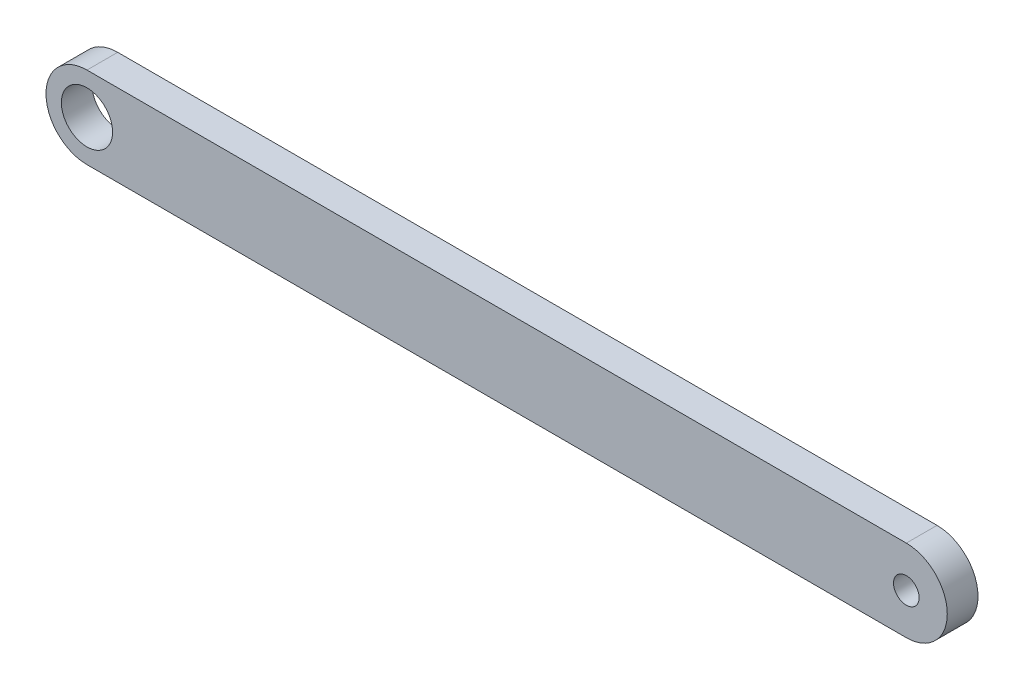
ISO-10303-21;
HEADER;
FILE_DESCRIPTION(('STEP AP214'),'2;1');
FILE_NAME('part.step','',(''),(''),'','','');
FILE_SCHEMA(('AUTOMOTIVE_DESIGN { 1 0 10303 214 1 1 1 1 }'));
ENDSEC;
DATA;
#1=APPLICATION_CONTEXT('core data for automotive mechanical design processes');
#2=APPLICATION_PROTOCOL_DEFINITION('international standard','automotive_design',2000,#1);
#3=PRODUCT_CONTEXT('',#1,'mechanical');
#4=PRODUCT('Part','Part','',(#3));
#5=PRODUCT_RELATED_PRODUCT_CATEGORY('part','',(#4));
#6=PRODUCT_DEFINITION_FORMATION('','',#4);
#7=PRODUCT_DEFINITION_CONTEXT('part definition',#1,'design');
#8=PRODUCT_DEFINITION('design','',#6,#7);
#9=PRODUCT_DEFINITION_SHAPE('','',#8);
#10=(LENGTH_UNIT() NAMED_UNIT(*) SI_UNIT(.MILLI.,.METRE.));
#11=(NAMED_UNIT(*) PLANE_ANGLE_UNIT() SI_UNIT($,.RADIAN.));
#12=(NAMED_UNIT(*) SI_UNIT($,.STERADIAN.) SOLID_ANGLE_UNIT());
#13=UNCERTAINTY_MEASURE_WITH_UNIT(LENGTH_MEASURE(1.E-05),#10,'distance_accuracy_value','');
#14=(GEOMETRIC_REPRESENTATION_CONTEXT(3) GLOBAL_UNCERTAINTY_ASSIGNED_CONTEXT((#13)) GLOBAL_UNIT_ASSIGNED_CONTEXT((#10,
#11,#12)) REPRESENTATION_CONTEXT('',''));
#15=CARTESIAN_POINT('',(0.,0.,0.));
#16=DIRECTION('',(0.,0.,1.));
#17=DIRECTION('',(1.,0.,0.));
#18=AXIS2_PLACEMENT_3D('',#15,#16,#17);
#19=CARTESIAN_POINT('',(-54.3710287071592,0.,6.));
#20=DIRECTION('',(0.,0.,1.));
#21=DIRECTION('',(1.,0.,0.));
#22=AXIS2_PLACEMENT_3D('',#19,#20,#21);
#23=PLANE('',#22);
#24=CARTESIAN_POINT('',(-54.3710287071592,0.,6.));
#25=DIRECTION('',(0.,0.,1.));
#26=DIRECTION('',(1.,0.,0.));
#27=AXIS2_PLACEMENT_3D('',#24,#25,#26);
#28=CIRCLE('',#27,5.);
#29=CARTESIAN_POINT('',(-49.3710287071592,0.,6.));
#30=VERTEX_POINT('',#29);
#31=EDGE_CURVE('E100',#30,#30,#28,.T.);
#32=ORIENTED_EDGE('',*,*,#31,.F.);
#33=EDGE_LOOP('',(#32));
#34=FACE_BOUND('',#33,.T.);
#35=CARTESIAN_POINT('',(-54.3710287071592,0.,6.));
#36=DIRECTION('',(0.,0.,1.));
#37=DIRECTION('',(1.,0.,0.));
#38=AXIS2_PLACEMENT_3D('',#35,#36,#37);
#39=CIRCLE('',#38,8.);
#40=CARTESIAN_POINT('',(-54.3710287071592,8.,6.));
#41=VERTEX_POINT('',#40);
#42=CARTESIAN_POINT('',(-54.3710287071592,-8.,6.));
#43=VERTEX_POINT('',#42);
#44=EDGE_CURVE('E85',#41,#43,#39,.T.);
#45=ORIENTED_EDGE('',*,*,#44,.T.);
#46=DIRECTION('',(1.,0.,0.));
#47=VECTOR('',#46,1.);
#48=CARTESIAN_POINT('',(-54.3710287071592,-8.,6.));
#49=LINE('',#48,#47);
#50=CARTESIAN_POINT('',(105.628971292841,-8.,6.));
#51=VERTEX_POINT('',#50);
#52=EDGE_CURVE('E80',#43,#51,#49,.T.);
#53=ORIENTED_EDGE('',*,*,#52,.T.);
#54=CARTESIAN_POINT('',(105.628971292841,0.,6.));
#55=DIRECTION('',(0.,0.,1.));
#56=DIRECTION('',(1.,0.,0.));
#57=AXIS2_PLACEMENT_3D('',#54,#55,#56);
#58=CIRCLE('',#57,8.);
#59=CARTESIAN_POINT('',(105.628971292841,8.,6.));
#60=VERTEX_POINT('',#59);
#61=EDGE_CURVE('E83',#51,#60,#58,.T.);
#62=ORIENTED_EDGE('',*,*,#61,.T.);
#63=DIRECTION('',(-1.,0.,0.));
#64=VECTOR('',#63,1.);
#65=CARTESIAN_POINT('',(-54.3710287071592,8.,6.));
#66=LINE('',#65,#64);
#67=EDGE_CURVE('E50',#60,#41,#66,.T.);
#68=ORIENTED_EDGE('',*,*,#67,.T.);
#69=EDGE_LOOP('',(#45,#53,#62,#68));
#70=FACE_BOUND('',#69,.T.);
#71=CARTESIAN_POINT('',(105.628971292841,0.,6.));
#72=DIRECTION('',(0.,0.,1.));
#73=DIRECTION('',(1.,0.,0.));
#74=AXIS2_PLACEMENT_3D('',#71,#72,#73);
#75=CIRCLE('',#74,2.5);
#76=CARTESIAN_POINT('',(108.128971292841,0.,6.));
#77=VERTEX_POINT('',#76);
#78=EDGE_CURVE('E115',#77,#77,#75,.T.);
#79=ORIENTED_EDGE('',*,*,#78,.F.);
#80=EDGE_LOOP('',(#79));
#81=FACE_BOUND('',#80,.T.);
#82=ADVANCED_FACE('F33',(#34,#70,#81),#23,.T.);
#83=CARTESIAN_POINT('',(-54.3710287071592,0.,0.));
#84=DIRECTION('',(0.,0.,1.));
#85=DIRECTION('',(1.,0.,0.));
#86=AXIS2_PLACEMENT_3D('',#83,#84,#85);
#87=PLANE('',#86);
#88=CARTESIAN_POINT('',(-54.3710287071592,0.,0.));
#89=DIRECTION('',(0.,0.,1.));
#90=DIRECTION('',(1.,0.,0.));
#91=AXIS2_PLACEMENT_3D('',#88,#89,#90);
#92=CIRCLE('',#91,8.);
#93=CARTESIAN_POINT('',(-54.3710287071592,8.,0.));
#94=VERTEX_POINT('',#93);
#95=CARTESIAN_POINT('',(-54.3710287071592,-8.,0.));
#96=VERTEX_POINT('',#95);
#97=EDGE_CURVE('E97',#94,#96,#92,.T.);
#98=ORIENTED_EDGE('',*,*,#97,.F.);
#99=DIRECTION('',(-1.,0.,0.));
#100=VECTOR('',#99,1.);
#101=CARTESIAN_POINT('',(-54.3710287071592,8.,0.));
#102=LINE('',#101,#100);
#103=CARTESIAN_POINT('',(105.628971292841,8.,0.));
#104=VERTEX_POINT('',#103);
#105=EDGE_CURVE('E73',#104,#94,#102,.T.);
#106=ORIENTED_EDGE('',*,*,#105,.F.);
#107=CARTESIAN_POINT('',(105.628971292841,0.,0.));
#108=DIRECTION('',(0.,0.,1.));
#109=DIRECTION('',(1.,0.,0.));
#110=AXIS2_PLACEMENT_3D('',#107,#108,#109);
#111=CIRCLE('',#110,8.);
#112=CARTESIAN_POINT('',(105.628971292841,-8.,0.));
#113=VERTEX_POINT('',#112);
#114=EDGE_CURVE('E67',#113,#104,#111,.T.);
#115=ORIENTED_EDGE('',*,*,#114,.F.);
#116=DIRECTION('',(1.,0.,0.));
#117=VECTOR('',#116,1.);
#118=CARTESIAN_POINT('',(-54.3710287071592,-8.,0.));
#119=LINE('',#118,#117);
#120=EDGE_CURVE('E89',#96,#113,#119,.T.);
#121=ORIENTED_EDGE('',*,*,#120,.F.);
#122=EDGE_LOOP('',(#98,#106,#115,#121));
#123=FACE_BOUND('',#122,.T.);
#124=CARTESIAN_POINT('',(-54.3710287071592,0.,0.));
#125=DIRECTION('',(0.,0.,1.));
#126=DIRECTION('',(1.,0.,0.));
#127=AXIS2_PLACEMENT_3D('',#124,#125,#126);
#128=CIRCLE('',#127,5.);
#129=CARTESIAN_POINT('',(-49.3710287071592,0.,0.));
#130=VERTEX_POINT('',#129);
#131=EDGE_CURVE('E112',#130,#130,#128,.T.);
#132=ORIENTED_EDGE('',*,*,#131,.T.);
#133=EDGE_LOOP('',(#132));
#134=FACE_BOUND('',#133,.T.);
#135=CARTESIAN_POINT('',(105.628971292841,0.,0.));
#136=DIRECTION('',(0.,0.,1.));
#137=DIRECTION('',(1.,0.,0.));
#138=AXIS2_PLACEMENT_3D('',#135,#136,#137);
#139=CIRCLE('',#138,2.5);
#140=CARTESIAN_POINT('',(108.128971292841,0.,0.));
#141=VERTEX_POINT('',#140);
#142=EDGE_CURVE('E118',#141,#141,#139,.T.);
#143=ORIENTED_EDGE('',*,*,#142,.T.);
#144=EDGE_LOOP('',(#143));
#145=FACE_BOUND('',#144,.T.);
#146=ADVANCED_FACE('F108',(#123,#134,#145),#87,.F.);
#147=CARTESIAN_POINT('',(-54.3710287071592,0.,6.));
#148=DIRECTION('',(0.,0.,-1.));
#149=DIRECTION('',(-1.,0.,0.));
#150=AXIS2_PLACEMENT_3D('',#147,#148,#149);
#151=CYLINDRICAL_SURFACE('',#150,8.);
#152=ORIENTED_EDGE('',*,*,#97,.T.);
#153=DIRECTION('',(0.,0.,-1.));
#154=VECTOR('',#153,1.);
#155=CARTESIAN_POINT('',(-54.3710287071592,-8.,6.));
#156=LINE('',#155,#154);
#157=EDGE_CURVE('E11',#43,#96,#156,.T.);
#158=ORIENTED_EDGE('',*,*,#157,.F.);
#159=ORIENTED_EDGE('',*,*,#44,.F.);
#160=DIRECTION('',(0.,0.,-1.));
#161=VECTOR('',#160,1.);
#162=CARTESIAN_POINT('',(-54.3710287071592,8.,6.));
#163=LINE('',#162,#161);
#164=EDGE_CURVE('E93',#41,#94,#163,.T.);
#165=ORIENTED_EDGE('',*,*,#164,.T.);
#166=EDGE_LOOP('',(#152,#158,#159,#165));
#167=FACE_BOUND('',#166,.T.);
#168=ADVANCED_FACE('F35',(#167),#151,.T.);
#169=CARTESIAN_POINT('',(-54.3710287071592,-8.,6.));
#170=DIRECTION('',(0.,1.,0.));
#171=DIRECTION('',(0.,0.,1.));
#172=AXIS2_PLACEMENT_3D('',#169,#170,#171);
#173=PLANE('',#172);
#174=ORIENTED_EDGE('',*,*,#120,.T.);
#175=DIRECTION('',(0.,0.,-1.));
#176=VECTOR('',#175,1.);
#177=CARTESIAN_POINT('',(105.628971292841,-8.,6.));
#178=LINE('',#177,#176);
#179=EDGE_CURVE('E42',#51,#113,#178,.T.);
#180=ORIENTED_EDGE('',*,*,#179,.F.);
#181=ORIENTED_EDGE('',*,*,#52,.F.);
#182=ORIENTED_EDGE('',*,*,#157,.T.);
#183=EDGE_LOOP('',(#174,#180,#181,#182));
#184=FACE_BOUND('',#183,.T.);
#185=ADVANCED_FACE('F88',(#184),#173,.F.);
#186=CARTESIAN_POINT('',(105.628971292841,0.,6.));
#187=DIRECTION('',(0.,0.,-1.));
#188=DIRECTION('',(-1.,0.,0.));
#189=AXIS2_PLACEMENT_3D('',#186,#187,#188);
#190=CYLINDRICAL_SURFACE('',#189,8.);
#191=ORIENTED_EDGE('',*,*,#114,.T.);
#192=DIRECTION('',(0.,0.,-1.));
#193=VECTOR('',#192,1.);
#194=CARTESIAN_POINT('',(105.628971292841,8.,6.));
#195=LINE('',#194,#193);
#196=EDGE_CURVE('E90',#60,#104,#195,.T.);
#197=ORIENTED_EDGE('',*,*,#196,.F.);
#198=ORIENTED_EDGE('',*,*,#61,.F.);
#199=ORIENTED_EDGE('',*,*,#179,.T.);
#200=EDGE_LOOP('',(#191,#197,#198,#199));
#201=FACE_BOUND('',#200,.T.);
#202=ADVANCED_FACE('F91',(#201),#190,.T.);
#203=CARTESIAN_POINT('',(-54.3710287071592,8.,6.));
#204=DIRECTION('',(0.,-1.,0.));
#205=DIRECTION('',(0.,0.,-1.));
#206=AXIS2_PLACEMENT_3D('',#203,#204,#205);
#207=PLANE('',#206);
#208=ORIENTED_EDGE('',*,*,#105,.T.);
#209=ORIENTED_EDGE('',*,*,#164,.F.);
#210=ORIENTED_EDGE('',*,*,#67,.F.);
#211=ORIENTED_EDGE('',*,*,#196,.T.);
#212=EDGE_LOOP('',(#208,#209,#210,#211));
#213=FACE_BOUND('',#212,.T.);
#214=ADVANCED_FACE('F105',(#213),#207,.F.);
#215=CARTESIAN_POINT('',(-54.3710287071592,0.,6.));
#216=DIRECTION('',(0.,0.,-1.));
#217=DIRECTION('',(-1.,0.,0.));
#218=AXIS2_PLACEMENT_3D('',#215,#216,#217);
#219=CYLINDRICAL_SURFACE('',#218,5.);
#220=ORIENTED_EDGE('',*,*,#31,.T.);
#221=EDGE_LOOP('',(#220));
#222=FACE_BOUND('',#221,.T.);
#223=ORIENTED_EDGE('',*,*,#131,.F.);
#224=EDGE_LOOP('',(#223));
#225=FACE_BOUND('',#224,.T.);
#226=ADVANCED_FACE('F135',(#222,#225),#219,.F.);
#227=CARTESIAN_POINT('',(105.628971292841,0.,6.));
#228=DIRECTION('',(0.,0.,-1.));
#229=DIRECTION('',(-1.,0.,0.));
#230=AXIS2_PLACEMENT_3D('',#227,#228,#229);
#231=CYLINDRICAL_SURFACE('',#230,2.5);
#232=ORIENTED_EDGE('',*,*,#78,.T.);
#233=EDGE_LOOP('',(#232));
#234=FACE_BOUND('',#233,.T.);
#235=ORIENTED_EDGE('',*,*,#142,.F.);
#236=EDGE_LOOP('',(#235));
#237=FACE_BOUND('',#236,.T.);
#238=ADVANCED_FACE('F124',(#234,#237),#231,.F.);
#239=CLOSED_SHELL('',(#82,#146,#168,#185,#202,#214,#226,#238));
#240=MANIFOLD_SOLID_BREP('B2',#239);
#241=ADVANCED_BREP_SHAPE_REPRESENTATION('',(#18,#240),#14);
#242=SHAPE_DEFINITION_REPRESENTATION(#9,#241);
ENDSEC;
END-ISO-10303-21;
